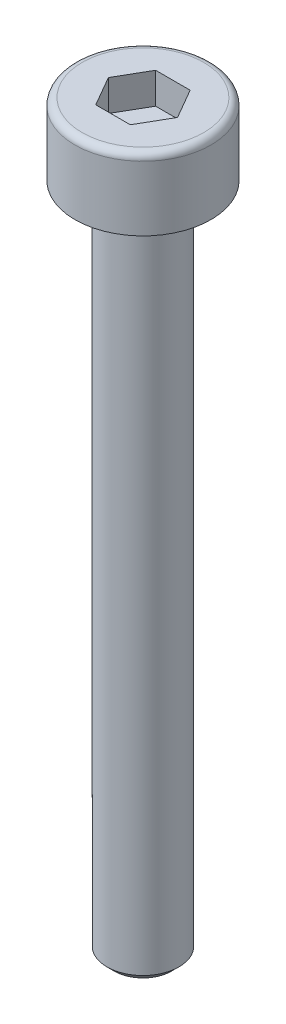
ISO-10303-21;
HEADER;
FILE_DESCRIPTION(('STEP AP214'),'2;1');
FILE_NAME('part.step','',(''),(''),'','','');
FILE_SCHEMA(('AUTOMOTIVE_DESIGN { 1 0 10303 214 1 1 1 1 }'));
ENDSEC;
DATA;
#1=APPLICATION_CONTEXT('core data for automotive mechanical design processes');
#2=APPLICATION_PROTOCOL_DEFINITION('international standard','automotive_design',2000,#1);
#3=PRODUCT_CONTEXT('',#1,'mechanical');
#4=PRODUCT('Part','Part','',(#3));
#5=PRODUCT_RELATED_PRODUCT_CATEGORY('part','',(#4));
#6=PRODUCT_DEFINITION_FORMATION('','',#4);
#7=PRODUCT_DEFINITION_CONTEXT('part definition',#1,'design');
#8=PRODUCT_DEFINITION('design','',#6,#7);
#9=PRODUCT_DEFINITION_SHAPE('','',#8);
#10=(LENGTH_UNIT() NAMED_UNIT(*) SI_UNIT(.MILLI.,.METRE.));
#11=(NAMED_UNIT(*) PLANE_ANGLE_UNIT() SI_UNIT($,.RADIAN.));
#12=(NAMED_UNIT(*) SI_UNIT($,.STERADIAN.) SOLID_ANGLE_UNIT());
#13=UNCERTAINTY_MEASURE_WITH_UNIT(LENGTH_MEASURE(1.E-05),#10,'distance_accuracy_value','');
#14=(GEOMETRIC_REPRESENTATION_CONTEXT(3) GLOBAL_UNCERTAINTY_ASSIGNED_CONTEXT((#13)) GLOBAL_UNIT_ASSIGNED_CONTEXT((#10,
#11,#12)) REPRESENTATION_CONTEXT('',''));
#15=CARTESIAN_POINT('',(0.,0.,0.));
#16=DIRECTION('',(0.,0.,1.));
#17=DIRECTION('',(1.,0.,0.));
#18=AXIS2_PLACEMENT_3D('',#15,#16,#17);
#19=CARTESIAN_POINT('',(0.,0.,0.));
#20=DIRECTION('',(0.,1.,0.));
#21=DIRECTION('',(0.,0.,1.));
#22=AXIS2_PLACEMENT_3D('',#19,#20,#21);
#23=PLANE('',#22);
#24=CARTESIAN_POINT('',(0.,0.,0.));
#25=DIRECTION('',(0.,1.,0.));
#26=DIRECTION('',(0.,0.,1.));
#27=AXIS2_PLACEMENT_3D('',#24,#25,#26);
#28=CIRCLE('',#27,1.6);
#29=CARTESIAN_POINT('',(0.,0.,1.6));
#30=VERTEX_POINT('',#29);
#31=EDGE_CURVE('E11',#30,#30,#28,.T.);
#32=ORIENTED_EDGE('',*,*,#31,.T.);
#33=EDGE_LOOP('',(#32));
#34=FACE_BOUND('',#33,.T.);
#35=CARTESIAN_POINT('',(0.,0.,0.));
#36=DIRECTION('',(0.,1.,0.));
#37=DIRECTION('',(0.,0.,1.));
#38=AXIS2_PLACEMENT_3D('',#35,#36,#37);
#39=CIRCLE('',#38,2.84);
#40=CARTESIAN_POINT('',(0.,0.,2.84));
#41=VERTEX_POINT('',#40);
#42=EDGE_CURVE('E136',#41,#41,#39,.T.);
#43=ORIENTED_EDGE('',*,*,#42,.F.);
#44=EDGE_LOOP('',(#43));
#45=FACE_BOUND('',#44,.T.);
#46=ADVANCED_FACE('F34',(#34,#45),#23,.F.);
#47=CARTESIAN_POINT('',(0.,3.,0.));
#48=DIRECTION('',(0.,-1.,0.));
#49=DIRECTION('',(0.,0.,-1.));
#50=AXIS2_PLACEMENT_3D('',#47,#48,#49);
#51=CYLINDRICAL_SURFACE('',#50,2.84);
#52=CARTESIAN_POINT('',(0.,2.7,0.));
#53=DIRECTION('',(0.,1.,0.));
#54=DIRECTION('',(0.,0.,1.));
#55=AXIS2_PLACEMENT_3D('',#52,#53,#54);
#56=CIRCLE('',#55,2.84);
#57=CARTESIAN_POINT('',(0.,2.7,2.84));
#58=VERTEX_POINT('',#57);
#59=EDGE_CURVE('E153',#58,#58,#56,.F.);
#60=ORIENTED_EDGE('',*,*,#59,.T.);
#61=EDGE_LOOP('',(#60));
#62=FACE_BOUND('',#61,.T.);
#63=ORIENTED_EDGE('',*,*,#42,.T.);
#64=EDGE_LOOP('',(#63));
#65=FACE_BOUND('',#64,.T.);
#66=ADVANCED_FACE('F171',(#62,#65),#51,.T.);
#67=CARTESIAN_POINT('',(0.,3.,0.));
#68=DIRECTION('',(0.,1.,0.));
#69=DIRECTION('',(0.,0.,1.));
#70=AXIS2_PLACEMENT_3D('',#67,#68,#69);
#71=PLANE('',#70);
#72=CARTESIAN_POINT('',(0.,3.,0.));
#73=DIRECTION('',(0.,1.,0.));
#74=DIRECTION('',(0.,0.,1.));
#75=AXIS2_PLACEMENT_3D('',#72,#73,#74);
#76=CIRCLE('',#75,2.54);
#77=CARTESIAN_POINT('',(0.,3.,2.54));
#78=VERTEX_POINT('',#77);
#79=EDGE_CURVE('E150',#78,#78,#76,.T.);
#80=ORIENTED_EDGE('',*,*,#79,.T.);
#81=EDGE_LOOP('',(#80));
#82=FACE_BOUND('',#81,.T.);
#83=DIRECTION('',(0.5,0.,-0.866025403784439));
#84=VECTOR('',#83,1.);
#85=CARTESIAN_POINT('',(0.721687836487033,3.,1.25));
#86=LINE('',#85,#84);
#87=CARTESIAN_POINT('',(0.721687836487033,3.,1.25));
#88=VERTEX_POINT('',#87);
#89=CARTESIAN_POINT('',(1.44337567297407,3.,0.));
#90=VERTEX_POINT('',#89);
#91=EDGE_CURVE('E49',#88,#90,#86,.T.);
#92=ORIENTED_EDGE('',*,*,#91,.F.);
#93=DIRECTION('',(1.,0.,0.));
#94=VECTOR('',#93,1.);
#95=CARTESIAN_POINT('',(-0.721687836487032,3.,1.25));
#96=LINE('',#95,#94);
#97=CARTESIAN_POINT('',(-0.721687836487032,3.,1.25));
#98=VERTEX_POINT('',#97);
#99=EDGE_CURVE('E132',#98,#88,#96,.T.);
#100=ORIENTED_EDGE('',*,*,#99,.F.);
#101=DIRECTION('',(0.5,0.,0.866025403784439));
#102=VECTOR('',#101,1.);
#103=CARTESIAN_POINT('',(-1.44337567297406,3.,0.));
#104=LINE('',#103,#102);
#105=CARTESIAN_POINT('',(-1.44337567297406,3.,0.));
#106=VERTEX_POINT('',#105);
#107=EDGE_CURVE('E130',#106,#98,#104,.T.);
#108=ORIENTED_EDGE('',*,*,#107,.F.);
#109=DIRECTION('',(-0.5,0.,0.866025403784438));
#110=VECTOR('',#109,1.);
#111=CARTESIAN_POINT('',(-0.721687836487032,3.,-1.25));
#112=LINE('',#111,#110);
#113=CARTESIAN_POINT('',(-0.721687836487032,3.,-1.25));
#114=VERTEX_POINT('',#113);
#115=EDGE_CURVE('E97',#114,#106,#112,.T.);
#116=ORIENTED_EDGE('',*,*,#115,.F.);
#117=DIRECTION('',(-1.,0.,0.));
#118=VECTOR('',#117,1.);
#119=CARTESIAN_POINT('',(0.721687836487032,3.,-1.25));
#120=LINE('',#119,#118);
#121=CARTESIAN_POINT('',(0.721687836487032,3.,-1.25));
#122=VERTEX_POINT('',#121);
#123=EDGE_CURVE('E126',#122,#114,#120,.T.);
#124=ORIENTED_EDGE('',*,*,#123,.F.);
#125=DIRECTION('',(-0.5,0.,-0.866025403784438));
#126=VECTOR('',#125,1.);
#127=CARTESIAN_POINT('',(1.44337567297407,3.,0.));
#128=LINE('',#127,#126);
#129=EDGE_CURVE('E123',#90,#122,#128,.T.);
#130=ORIENTED_EDGE('',*,*,#129,.F.);
#131=EDGE_LOOP('',(#92,#100,#108,#116,#124,#130));
#132=FACE_BOUND('',#131,.T.);
#133=ADVANCED_FACE('F177',(#82,#132),#71,.T.);
#134=CARTESIAN_POINT('',(0.721687836487033,1.7,1.25));
#135=DIRECTION('',(0.866025403784439,0.,0.5));
#136=DIRECTION('',(0.5,0.,-0.866025403784439));
#137=AXIS2_PLACEMENT_3D('',#134,#135,#136);
#138=PLANE('',#137);
#139=ORIENTED_EDGE('',*,*,#91,.T.);
#140=DIRECTION('',(0.,1.,0.));
#141=VECTOR('',#140,1.);
#142=CARTESIAN_POINT('',(1.44337567297407,1.7,0.));
#143=LINE('',#142,#141);
#144=CARTESIAN_POINT('',(1.44337567297407,1.7,0.));
#145=VERTEX_POINT('',#144);
#146=EDGE_CURVE('E79',#145,#90,#143,.T.);
#147=ORIENTED_EDGE('',*,*,#146,.F.);
#148=DIRECTION('',(0.5,0.,-0.866025403784439));
#149=VECTOR('',#148,1.);
#150=CARTESIAN_POINT('',(0.721687836487033,1.7,1.25));
#151=LINE('',#150,#149);
#152=CARTESIAN_POINT('',(0.721687836487033,1.7,1.25));
#153=VERTEX_POINT('',#152);
#154=EDGE_CURVE('E134',#153,#145,#151,.T.);
#155=ORIENTED_EDGE('',*,*,#154,.F.);
#156=DIRECTION('',(0.,1.,0.));
#157=VECTOR('',#156,1.);
#158=CARTESIAN_POINT('',(0.721687836487033,1.7,1.25));
#159=LINE('',#158,#157);
#160=EDGE_CURVE('E57',#153,#88,#159,.T.);
#161=ORIENTED_EDGE('',*,*,#160,.T.);
#162=EDGE_LOOP('',(#139,#147,#155,#161));
#163=FACE_BOUND('',#162,.T.);
#164=ADVANCED_FACE('F206',(#163),#138,.F.);
#165=CARTESIAN_POINT('',(-0.721687836487032,1.7,1.25));
#166=DIRECTION('',(0.,0.,1.));
#167=DIRECTION('',(1.,0.,0.));
#168=AXIS2_PLACEMENT_3D('',#165,#166,#167);
#169=PLANE('',#168);
#170=ORIENTED_EDGE('',*,*,#99,.T.);
#171=ORIENTED_EDGE('',*,*,#160,.F.);
#172=DIRECTION('',(1.,0.,0.));
#173=VECTOR('',#172,1.);
#174=CARTESIAN_POINT('',(-0.721687836487032,1.7,1.25));
#175=LINE('',#174,#173);
#176=CARTESIAN_POINT('',(-0.721687836487032,1.7,1.25));
#177=VERTEX_POINT('',#176);
#178=EDGE_CURVE('E109',#177,#153,#175,.T.);
#179=ORIENTED_EDGE('',*,*,#178,.F.);
#180=DIRECTION('',(0.,1.,0.));
#181=VECTOR('',#180,1.);
#182=CARTESIAN_POINT('',(-0.721687836487032,1.7,1.25));
#183=LINE('',#182,#181);
#184=EDGE_CURVE('E101',#177,#98,#183,.T.);
#185=ORIENTED_EDGE('',*,*,#184,.T.);
#186=EDGE_LOOP('',(#170,#171,#179,#185));
#187=FACE_BOUND('',#186,.T.);
#188=ADVANCED_FACE('F203',(#187),#169,.F.);
#189=CARTESIAN_POINT('',(-1.44337567297406,1.7,0.));
#190=DIRECTION('',(-0.866025403784439,0.,0.5));
#191=DIRECTION('',(0.5,0.,0.866025403784439));
#192=AXIS2_PLACEMENT_3D('',#189,#190,#191);
#193=PLANE('',#192);
#194=ORIENTED_EDGE('',*,*,#107,.T.);
#195=ORIENTED_EDGE('',*,*,#184,.F.);
#196=DIRECTION('',(0.5,0.,0.866025403784439));
#197=VECTOR('',#196,1.);
#198=CARTESIAN_POINT('',(-1.44337567297406,1.7,0.));
#199=LINE('',#198,#197);
#200=CARTESIAN_POINT('',(-1.44337567297406,1.7,0.));
#201=VERTEX_POINT('',#200);
#202=EDGE_CURVE('E105',#201,#177,#199,.T.);
#203=ORIENTED_EDGE('',*,*,#202,.F.);
#204=DIRECTION('',(0.,1.,0.));
#205=VECTOR('',#204,1.);
#206=CARTESIAN_POINT('',(-1.44337567297406,1.7,0.));
#207=LINE('',#206,#205);
#208=EDGE_CURVE('E90',#201,#106,#207,.T.);
#209=ORIENTED_EDGE('',*,*,#208,.T.);
#210=EDGE_LOOP('',(#194,#195,#203,#209));
#211=FACE_BOUND('',#210,.T.);
#212=ADVANCED_FACE('F106',(#211),#193,.F.);
#213=CARTESIAN_POINT('',(-0.721687836487032,1.7,-1.25));
#214=DIRECTION('',(-0.866025403784439,0.,-0.5));
#215=DIRECTION('',(-0.5,0.,0.866025403784439));
#216=AXIS2_PLACEMENT_3D('',#213,#214,#215);
#217=PLANE('',#216);
#218=ORIENTED_EDGE('',*,*,#115,.T.);
#219=ORIENTED_EDGE('',*,*,#208,.F.);
#220=DIRECTION('',(-0.5,0.,0.866025403784438));
#221=VECTOR('',#220,1.);
#222=CARTESIAN_POINT('',(-0.721687836487032,1.7,-1.25));
#223=LINE('',#222,#221);
#224=CARTESIAN_POINT('',(-0.721687836487032,1.7,-1.25));
#225=VERTEX_POINT('',#224);
#226=EDGE_CURVE('E94',#225,#201,#223,.T.);
#227=ORIENTED_EDGE('',*,*,#226,.F.);
#228=DIRECTION('',(0.,1.,0.));
#229=VECTOR('',#228,1.);
#230=CARTESIAN_POINT('',(-0.721687836487032,1.7,-1.25));
#231=LINE('',#230,#229);
#232=EDGE_CURVE('E102',#225,#114,#231,.T.);
#233=ORIENTED_EDGE('',*,*,#232,.T.);
#234=EDGE_LOOP('',(#218,#219,#227,#233));
#235=FACE_BOUND('',#234,.T.);
#236=ADVANCED_FACE('F92',(#235),#217,.F.);
#237=CARTESIAN_POINT('',(0.721687836487032,1.7,-1.25));
#238=DIRECTION('',(0.,0.,-1.));
#239=DIRECTION('',(-1.,0.,0.));
#240=AXIS2_PLACEMENT_3D('',#237,#238,#239);
#241=PLANE('',#240);
#242=ORIENTED_EDGE('',*,*,#123,.T.);
#243=ORIENTED_EDGE('',*,*,#232,.F.);
#244=DIRECTION('',(-1.,0.,0.));
#245=VECTOR('',#244,1.);
#246=CARTESIAN_POINT('',(0.721687836487032,1.7,-1.25));
#247=LINE('',#246,#245);
#248=CARTESIAN_POINT('',(0.721687836487032,1.7,-1.25));
#249=VERTEX_POINT('',#248);
#250=EDGE_CURVE('E115',#249,#225,#247,.T.);
#251=ORIENTED_EDGE('',*,*,#250,.F.);
#252=DIRECTION('',(0.,1.,0.));
#253=VECTOR('',#252,1.);
#254=CARTESIAN_POINT('',(0.721687836487032,1.7,-1.25));
#255=LINE('',#254,#253);
#256=EDGE_CURVE('E139',#249,#122,#255,.T.);
#257=ORIENTED_EDGE('',*,*,#256,.T.);
#258=EDGE_LOOP('',(#242,#243,#251,#257));
#259=FACE_BOUND('',#258,.T.);
#260=ADVANCED_FACE('F211',(#259),#241,.F.);
#261=CARTESIAN_POINT('',(1.44337567297407,1.7,0.));
#262=DIRECTION('',(0.866025403784438,0.,-0.5));
#263=DIRECTION('',(-0.5,0.,-0.866025403784438));
#264=AXIS2_PLACEMENT_3D('',#261,#262,#263);
#265=PLANE('',#264);
#266=ORIENTED_EDGE('',*,*,#129,.T.);
#267=ORIENTED_EDGE('',*,*,#256,.F.);
#268=DIRECTION('',(-0.5,0.,-0.866025403784438));
#269=VECTOR('',#268,1.);
#270=CARTESIAN_POINT('',(1.44337567297407,1.7,0.));
#271=LINE('',#270,#269);
#272=EDGE_CURVE('E117',#145,#249,#271,.T.);
#273=ORIENTED_EDGE('',*,*,#272,.F.);
#274=ORIENTED_EDGE('',*,*,#146,.T.);
#275=EDGE_LOOP('',(#266,#267,#273,#274));
#276=FACE_BOUND('',#275,.T.);
#277=ADVANCED_FACE('F200',(#276),#265,.F.);
#278=CARTESIAN_POINT('',(0.,1.7,0.));
#279=DIRECTION('',(0.,1.,0.));
#280=DIRECTION('',(0.,0.,1.));
#281=AXIS2_PLACEMENT_3D('',#278,#279,#280);
#282=PLANE('',#281);
#283=ORIENTED_EDGE('',*,*,#154,.T.);
#284=ORIENTED_EDGE('',*,*,#272,.T.);
#285=ORIENTED_EDGE('',*,*,#250,.T.);
#286=ORIENTED_EDGE('',*,*,#226,.T.);
#287=ORIENTED_EDGE('',*,*,#202,.T.);
#288=ORIENTED_EDGE('',*,*,#178,.T.);
#289=EDGE_LOOP('',(#283,#284,#285,#286,#287,#288));
#290=FACE_BOUND('',#289,.T.);
#291=ADVANCED_FACE('F112',(#290),#282,.T.);
#292=CARTESIAN_POINT('',(0.,-28.,0.));
#293=DIRECTION('',(0.,1.,0.));
#294=DIRECTION('',(0.,0.,1.));
#295=AXIS2_PLACEMENT_3D('',#292,#293,#294);
#296=CYLINDRICAL_SURFACE('',#295,1.5);
#297=CARTESIAN_POINT('',(0.,-0.100000000000003,0.));
#298=DIRECTION('',(0.,1.,0.));
#299=DIRECTION('',(0.,0.,1.));
#300=AXIS2_PLACEMENT_3D('',#297,#298,#299);
#301=CIRCLE('',#300,1.5);
#302=CARTESIAN_POINT('',(0.,-0.100000000000003,1.5));
#303=VERTEX_POINT('',#302);
#304=EDGE_CURVE('E42',#303,#303,#301,.F.);
#305=ORIENTED_EDGE('',*,*,#304,.T.);
#306=EDGE_LOOP('',(#305));
#307=FACE_BOUND('',#306,.T.);
#308=CARTESIAN_POINT('',(0.,-27.7,0.));
#309=DIRECTION('',(0.,-1.,0.));
#310=DIRECTION('',(0.,0.,-1.));
#311=AXIS2_PLACEMENT_3D('',#308,#309,#310);
#312=CIRCLE('',#311,1.5);
#313=CARTESIAN_POINT('',(0.,-27.7,-1.5));
#314=VERTEX_POINT('',#313);
#315=EDGE_CURVE('E147',#314,#314,#312,.F.);
#316=ORIENTED_EDGE('',*,*,#315,.T.);
#317=EDGE_LOOP('',(#316));
#318=FACE_BOUND('',#317,.T.);
#319=ADVANCED_FACE('F158',(#307,#318),#296,.T.);
#320=CARTESIAN_POINT('',(0.,-28.,0.));
#321=DIRECTION('',(0.,-1.,0.));
#322=DIRECTION('',(0.,0.,-1.));
#323=AXIS2_PLACEMENT_3D('',#320,#321,#322);
#324=PLANE('',#323);
#325=CARTESIAN_POINT('',(0.,-28.,0.));
#326=DIRECTION('',(0.,-1.,0.));
#327=DIRECTION('',(0.,0.,-1.));
#328=AXIS2_PLACEMENT_3D('',#325,#326,#327);
#329=CIRCLE('',#328,1.2);
#330=CARTESIAN_POINT('',(0.,-28.,-1.2));
#331=VERTEX_POINT('',#330);
#332=EDGE_CURVE('E144',#331,#331,#329,.T.);
#333=ORIENTED_EDGE('',*,*,#332,.T.);
#334=EDGE_LOOP('',(#333));
#335=FACE_BOUND('',#334,.T.);
#336=ADVANCED_FACE('F185',(#335),#324,.T.);
#337=CARTESIAN_POINT('',(0.,-28.,0.));
#338=DIRECTION('',(0.,1.,0.));
#339=DIRECTION('',(0.,0.,1.));
#340=AXIS2_PLACEMENT_3D('',#337,#338,#339);
#341=CONICAL_SURFACE('',#340,1.2,0.785398163397458);
#342=ORIENTED_EDGE('',*,*,#315,.F.);
#343=EDGE_LOOP('',(#342));
#344=FACE_BOUND('',#343,.T.);
#345=ORIENTED_EDGE('',*,*,#332,.F.);
#346=EDGE_LOOP('',(#345));
#347=FACE_BOUND('',#346,.T.);
#348=ADVANCED_FACE('F167',(#344,#347),#341,.T.);
#349=CARTESIAN_POINT('',(0.,2.7,0.));
#350=DIRECTION('',(0.,1.,0.));
#351=DIRECTION('',(0.,0.,1.));
#352=AXIS2_PLACEMENT_3D('',#349,#350,#351);
#353=TOROIDAL_SURFACE('',#352,2.54,0.3);
#354=ORIENTED_EDGE('',*,*,#59,.F.);
#355=EDGE_LOOP('',(#354));
#356=FACE_BOUND('',#355,.T.);
#357=ORIENTED_EDGE('',*,*,#79,.F.);
#358=EDGE_LOOP('',(#357));
#359=FACE_BOUND('',#358,.T.);
#360=ADVANCED_FACE('F162',(#356,#359),#353,.T.);
#361=CARTESIAN_POINT('',(0.,-0.100000000000003,0.));
#362=DIRECTION('',(0.,1.,0.));
#363=DIRECTION('',(0.,0.,1.));
#364=AXIS2_PLACEMENT_3D('',#361,#362,#363);
#365=CONICAL_SURFACE('',#364,1.5,0.785398163397419);
#366=ORIENTED_EDGE('',*,*,#31,.F.);
#367=EDGE_LOOP('',(#366));
#368=FACE_BOUND('',#367,.T.);
#369=ORIENTED_EDGE('',*,*,#304,.F.);
#370=EDGE_LOOP('',(#369));
#371=FACE_BOUND('',#370,.T.);
#372=ADVANCED_FACE('F36',(#368,#371),#365,.T.);
#373=CLOSED_SHELL('',(#46,#66,#133,#164,#188,#212,#236,#260,#277,#291,#319,#336,#348,#360,#372));
#374=MANIFOLD_SOLID_BREP('B2',#373);
#375=ADVANCED_BREP_SHAPE_REPRESENTATION('',(#18,#374),#14);
#376=SHAPE_DEFINITION_REPRESENTATION(#9,#375);
ENDSEC;
END-ISO-10303-21;
